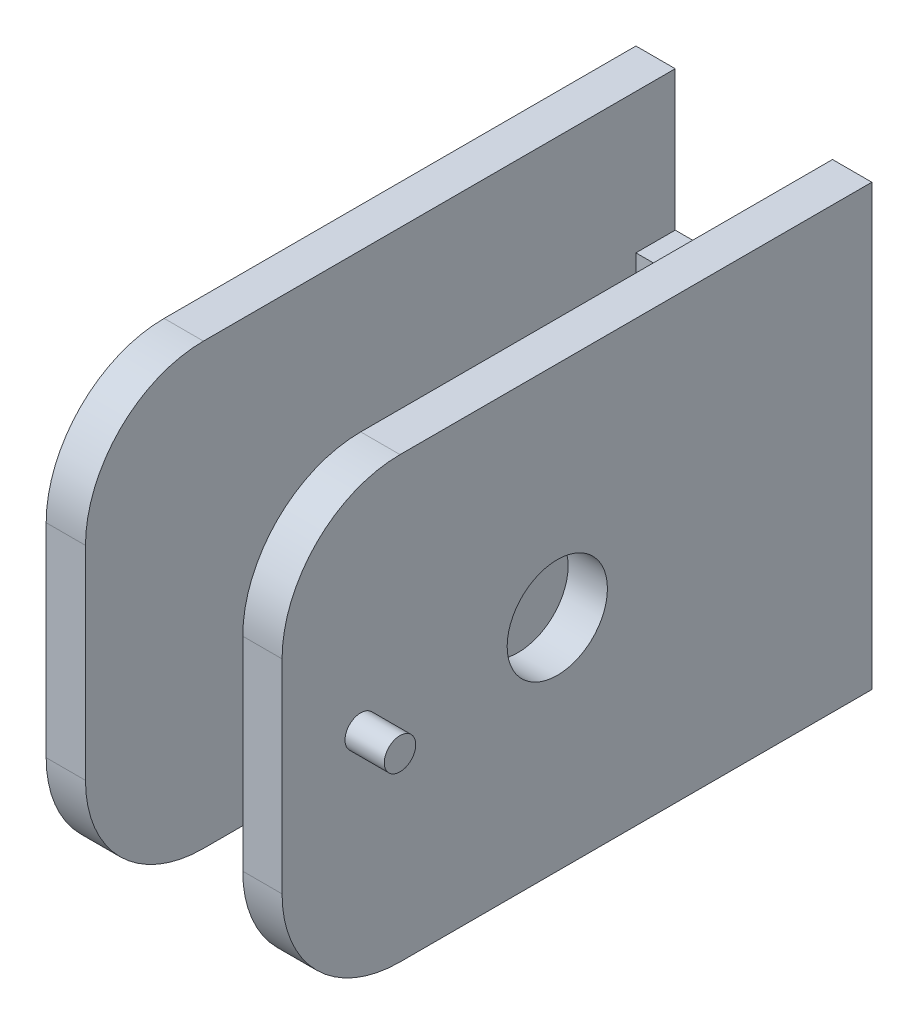
ISO-10303-21;
HEADER;
FILE_DESCRIPTION(('STEP AP214'),'2;1');
FILE_NAME('part.step','',(''),(''),'','','');
FILE_SCHEMA(('AUTOMOTIVE_DESIGN { 1 0 10303 214 1 1 1 1 }'));
ENDSEC;
DATA;
#1=APPLICATION_CONTEXT('core data for automotive mechanical design processes');
#2=APPLICATION_PROTOCOL_DEFINITION('international standard','automotive_design',2000,#1);
#3=PRODUCT_CONTEXT('',#1,'mechanical');
#4=PRODUCT('Part','Part','',(#3));
#5=PRODUCT_RELATED_PRODUCT_CATEGORY('part','',(#4));
#6=PRODUCT_DEFINITION_FORMATION('','',#4);
#7=PRODUCT_DEFINITION_CONTEXT('part definition',#1,'design');
#8=PRODUCT_DEFINITION('design','',#6,#7);
#9=PRODUCT_DEFINITION_SHAPE('','',#8);
#10=(LENGTH_UNIT() NAMED_UNIT(*) SI_UNIT(.MILLI.,.METRE.));
#11=(NAMED_UNIT(*) PLANE_ANGLE_UNIT() SI_UNIT($,.RADIAN.));
#12=(NAMED_UNIT(*) SI_UNIT($,.STERADIAN.) SOLID_ANGLE_UNIT());
#13=UNCERTAINTY_MEASURE_WITH_UNIT(LENGTH_MEASURE(1.E-05),#10,'distance_accuracy_value','');
#14=(GEOMETRIC_REPRESENTATION_CONTEXT(3) GLOBAL_UNCERTAINTY_ASSIGNED_CONTEXT((#13)) GLOBAL_UNIT_ASSIGNED_CONTEXT((#10,
#11,#12)) REPRESENTATION_CONTEXT('',''));
#15=CARTESIAN_POINT('',(0.,0.,0.));
#16=DIRECTION('',(0.,0.,1.));
#17=DIRECTION('',(1.,0.,0.));
#18=AXIS2_PLACEMENT_3D('',#15,#16,#17);
#19=CARTESIAN_POINT('',(-7.5,13.97,-20.));
#20=DIRECTION('',(0.,0.,1.));
#21=DIRECTION('',(1.,0.,0.));
#22=AXIS2_PLACEMENT_3D('',#19,#20,#21);
#23=PLANE('',#22);
#24=DIRECTION('',(0.,1.,0.));
#25=VECTOR('',#24,1.);
#26=CARTESIAN_POINT('',(5.,5.08,-20.));
#27=LINE('',#26,#25);
#28=CARTESIAN_POINT('',(5.,5.08,-20.));
#29=VERTEX_POINT('',#28);
#30=CARTESIAN_POINT('',(5.,13.97,-20.));
#31=VERTEX_POINT('',#30);
#32=EDGE_CURVE('E178',#29,#31,#27,.T.);
#33=ORIENTED_EDGE('',*,*,#32,.T.);
#34=DIRECTION('',(-1.,0.,0.));
#35=VECTOR('',#34,1.);
#36=CARTESIAN_POINT('',(-7.5,13.97,-20.));
#37=LINE('',#36,#35);
#38=CARTESIAN_POINT('',(7.5,13.97,-20.));
#39=VERTEX_POINT('',#38);
#40=EDGE_CURVE('E284',#39,#31,#37,.T.);
#41=ORIENTED_EDGE('',*,*,#40,.F.);
#42=DIRECTION('',(0.,-1.,0.));
#43=VECTOR('',#42,1.);
#44=CARTESIAN_POINT('',(7.5,13.97,-20.));
#45=LINE('',#44,#43);
#46=CARTESIAN_POINT('',(7.5,-13.97,-20.));
#47=VERTEX_POINT('',#46);
#48=EDGE_CURVE('E211',#39,#47,#45,.T.);
#49=ORIENTED_EDGE('',*,*,#48,.T.);
#50=DIRECTION('',(-1.,0.,0.));
#51=VECTOR('',#50,1.);
#52=CARTESIAN_POINT('',(-7.5,-13.97,-20.));
#53=LINE('',#52,#51);
#54=CARTESIAN_POINT('',(5.,-13.97,-20.));
#55=VERTEX_POINT('',#54);
#56=EDGE_CURVE('E302',#47,#55,#53,.T.);
#57=ORIENTED_EDGE('',*,*,#56,.T.);
#58=DIRECTION('',(0.,-1.,0.));
#59=VECTOR('',#58,1.);
#60=CARTESIAN_POINT('',(5.,-5.08,-20.));
#61=LINE('',#60,#59);
#62=CARTESIAN_POINT('',(5.,-5.08,-20.));
#63=VERTEX_POINT('',#62);
#64=EDGE_CURVE('E337',#63,#55,#61,.T.);
#65=ORIENTED_EDGE('',*,*,#64,.F.);
#66=DIRECTION('',(1.,0.,0.));
#67=VECTOR('',#66,1.);
#68=CARTESIAN_POINT('',(-5.,-5.08,-20.));
#69=LINE('',#68,#67);
#70=CARTESIAN_POINT('',(-5.,-5.08,-20.));
#71=VERTEX_POINT('',#70);
#72=EDGE_CURVE('E335',#71,#63,#69,.T.);
#73=ORIENTED_EDGE('',*,*,#72,.F.);
#74=DIRECTION('',(0.,1.,0.));
#75=VECTOR('',#74,1.);
#76=CARTESIAN_POINT('',(-5.,-5.08,-20.));
#77=LINE('',#76,#75);
#78=CARTESIAN_POINT('',(-5.,-13.97,-20.));
#79=VERTEX_POINT('',#78);
#80=EDGE_CURVE('E326',#79,#71,#77,.T.);
#81=ORIENTED_EDGE('',*,*,#80,.F.);
#82=CARTESIAN_POINT('',(-7.5,-13.97,-20.));
#83=VERTEX_POINT('',#82);
#84=EDGE_CURVE('E304',#79,#83,#53,.T.);
#85=ORIENTED_EDGE('',*,*,#84,.T.);
#86=DIRECTION('',(0.,-1.,0.));
#87=VECTOR('',#86,1.);
#88=CARTESIAN_POINT('',(-7.5,13.97,-20.));
#89=LINE('',#88,#87);
#90=CARTESIAN_POINT('',(-7.5,13.97,-20.));
#91=VERTEX_POINT('',#90);
#92=EDGE_CURVE('E207',#91,#83,#89,.T.);
#93=ORIENTED_EDGE('',*,*,#92,.F.);
#94=CARTESIAN_POINT('',(-5.,13.97,-20.));
#95=VERTEX_POINT('',#94);
#96=EDGE_CURVE('E357',#95,#91,#37,.T.);
#97=ORIENTED_EDGE('',*,*,#96,.F.);
#98=DIRECTION('',(0.,-1.,0.));
#99=VECTOR('',#98,1.);
#100=CARTESIAN_POINT('',(-5.,5.08,-20.));
#101=LINE('',#100,#99);
#102=CARTESIAN_POINT('',(-5.,5.08,-20.));
#103=VERTEX_POINT('',#102);
#104=EDGE_CURVE('E181',#95,#103,#101,.T.);
#105=ORIENTED_EDGE('',*,*,#104,.T.);
#106=DIRECTION('',(1.,0.,0.));
#107=VECTOR('',#106,1.);
#108=CARTESIAN_POINT('',(-5.,5.08,-20.));
#109=LINE('',#108,#107);
#110=EDGE_CURVE('E397',#103,#29,#109,.T.);
#111=ORIENTED_EDGE('',*,*,#110,.T.);
#112=EDGE_LOOP('',(#33,#41,#49,#57,#65,#73,#81,#85,#93,#97,#105,#111));
#113=FACE_BOUND('',#112,.T.);
#114=ADVANCED_FACE('F45',(#113),#23,.F.);
#115=CARTESIAN_POINT('',(-5.,13.97,-17.5));
#116=DIRECTION('',(0.,0.,-1.));
#117=DIRECTION('',(-1.,0.,0.));
#118=AXIS2_PLACEMENT_3D('',#115,#116,#117);
#119=PLANE('',#118);
#120=DIRECTION('',(-1.,0.,0.));
#121=VECTOR('',#120,1.);
#122=CARTESIAN_POINT('',(-5.,5.08,-17.5));
#123=LINE('',#122,#121);
#124=CARTESIAN_POINT('',(5.,5.08,-17.5));
#125=VERTEX_POINT('',#124);
#126=CARTESIAN_POINT('',(-5.,5.08,-17.5));
#127=VERTEX_POINT('',#126);
#128=EDGE_CURVE('E160',#125,#127,#123,.T.);
#129=ORIENTED_EDGE('',*,*,#128,.T.);
#130=DIRECTION('',(0.,-1.,0.));
#131=VECTOR('',#130,1.);
#132=CARTESIAN_POINT('',(-5.,13.97,-17.5));
#133=LINE('',#132,#131);
#134=CARTESIAN_POINT('',(-5.,-5.08,-17.5));
#135=VERTEX_POINT('',#134);
#136=EDGE_CURVE('E188',#127,#135,#133,.T.);
#137=ORIENTED_EDGE('',*,*,#136,.T.);
#138=DIRECTION('',(-1.,0.,0.));
#139=VECTOR('',#138,1.);
#140=CARTESIAN_POINT('',(-5.,-5.08,-17.5));
#141=LINE('',#140,#139);
#142=CARTESIAN_POINT('',(5.,-5.08,-17.5));
#143=VERTEX_POINT('',#142);
#144=EDGE_CURVE('E186',#143,#135,#141,.T.);
#145=ORIENTED_EDGE('',*,*,#144,.F.);
#146=DIRECTION('',(0.,-1.,0.));
#147=VECTOR('',#146,1.);
#148=CARTESIAN_POINT('',(5.,13.97,-17.5));
#149=LINE('',#148,#147);
#150=EDGE_CURVE('E175',#125,#143,#149,.T.);
#151=ORIENTED_EDGE('',*,*,#150,.F.);
#152=EDGE_LOOP('',(#129,#137,#145,#151));
#153=FACE_BOUND('',#152,.T.);
#154=ADVANCED_FACE('F184',(#153),#119,.F.);
#155=CARTESIAN_POINT('',(0.,13.97,0.));
#156=DIRECTION('',(0.,-1.,0.));
#157=DIRECTION('',(0.,0.,-1.));
#158=AXIS2_PLACEMENT_3D('',#155,#156,#157);
#159=PLANE('',#158);
#160=ORIENTED_EDGE('',*,*,#40,.T.);
#161=DIRECTION('',(0.,0.,1.));
#162=VECTOR('',#161,1.);
#163=CARTESIAN_POINT('',(5.,13.97,17.5));
#164=LINE('',#163,#162);
#165=CARTESIAN_POINT('',(5.,13.97,10.));
#166=VERTEX_POINT('',#165);
#167=EDGE_CURVE('E275',#31,#166,#164,.T.);
#168=ORIENTED_EDGE('',*,*,#167,.T.);
#169=DIRECTION('',(1.,0.,0.));
#170=VECTOR('',#169,1.);
#171=CARTESIAN_POINT('',(0.,13.97,10.));
#172=LINE('',#171,#170);
#173=CARTESIAN_POINT('',(7.5,13.97,10.));
#174=VERTEX_POINT('',#173);
#175=EDGE_CURVE('E249',#166,#174,#172,.T.);
#176=ORIENTED_EDGE('',*,*,#175,.T.);
#177=DIRECTION('',(0.,0.,-1.));
#178=VECTOR('',#177,1.);
#179=CARTESIAN_POINT('',(7.5,13.97,17.5));
#180=LINE('',#179,#178);
#181=EDGE_CURVE('E286',#174,#39,#180,.T.);
#182=ORIENTED_EDGE('',*,*,#181,.T.);
#183=EDGE_LOOP('',(#160,#168,#176,#182));
#184=FACE_BOUND('',#183,.T.);
#185=ADVANCED_FACE('F281',(#184),#159,.F.);
#186=DIRECTION('',(0.,0.,-1.));
#187=VECTOR('',#186,1.);
#188=CARTESIAN_POINT('',(-5.,13.97,17.5));
#189=LINE('',#188,#187);
#190=CARTESIAN_POINT('',(-5.,13.97,10.));
#191=VERTEX_POINT('',#190);
#192=EDGE_CURVE('E62',#191,#95,#189,.T.);
#193=ORIENTED_EDGE('',*,*,#192,.T.);
#194=ORIENTED_EDGE('',*,*,#96,.T.);
#195=DIRECTION('',(0.,0.,1.));
#196=VECTOR('',#195,1.);
#197=CARTESIAN_POINT('',(-7.5,13.97,17.5));
#198=LINE('',#197,#196);
#199=CARTESIAN_POINT('',(-7.5,13.97,10.));
#200=VERTEX_POINT('',#199);
#201=EDGE_CURVE('E194',#91,#200,#198,.T.);
#202=ORIENTED_EDGE('',*,*,#201,.T.);
#203=DIRECTION('',(1.,0.,0.));
#204=VECTOR('',#203,1.);
#205=CARTESIAN_POINT('',(0.,13.97,10.));
#206=LINE('',#205,#204);
#207=EDGE_CURVE('E253',#200,#191,#206,.T.);
#208=ORIENTED_EDGE('',*,*,#207,.T.);
#209=EDGE_LOOP('',(#193,#194,#202,#208));
#210=FACE_BOUND('',#209,.T.);
#211=ADVANCED_FACE('F355',(#210),#159,.F.);
#212=CARTESIAN_POINT('',(0.,-13.97,0.));
#213=DIRECTION('',(0.,-1.,0.));
#214=DIRECTION('',(0.,0.,-1.));
#215=AXIS2_PLACEMENT_3D('',#212,#213,#214);
#216=PLANE('',#215);
#217=DIRECTION('',(0.,0.,-1.));
#218=VECTOR('',#217,1.);
#219=CARTESIAN_POINT('',(7.5,-13.97,17.5));
#220=LINE('',#219,#218);
#221=CARTESIAN_POINT('',(7.5,-13.97,10.));
#222=VERTEX_POINT('',#221);
#223=EDGE_CURVE('E298',#222,#47,#220,.T.);
#224=ORIENTED_EDGE('',*,*,#223,.F.);
#225=DIRECTION('',(1.,0.,0.));
#226=VECTOR('',#225,1.);
#227=CARTESIAN_POINT('',(5.,-13.97,10.));
#228=LINE('',#227,#226);
#229=CARTESIAN_POINT('',(5.,-13.97,10.));
#230=VERTEX_POINT('',#229);
#231=EDGE_CURVE('E70',#222,#230,#228,.F.);
#232=ORIENTED_EDGE('',*,*,#231,.T.);
#233=DIRECTION('',(0.,0.,1.));
#234=VECTOR('',#233,1.);
#235=CARTESIAN_POINT('',(5.,-13.97,17.5));
#236=LINE('',#235,#234);
#237=EDGE_CURVE('E305',#55,#230,#236,.T.);
#238=ORIENTED_EDGE('',*,*,#237,.F.);
#239=ORIENTED_EDGE('',*,*,#56,.F.);
#240=EDGE_LOOP('',(#224,#232,#238,#239));
#241=FACE_BOUND('',#240,.T.);
#242=ADVANCED_FACE('F300',(#241),#216,.T.);
#243=CARTESIAN_POINT('',(5.,13.97,17.5));
#244=DIRECTION('',(1.,0.,0.));
#245=DIRECTION('',(0.,0.,-1.));
#246=AXIS2_PLACEMENT_3D('',#243,#244,#245);
#247=PLANE('',#246);
#248=CARTESIAN_POINT('',(5.,0.,0.));
#249=DIRECTION('',(1.,0.,0.));
#250=DIRECTION('',(0.,0.,-1.));
#251=AXIS2_PLACEMENT_3D('',#248,#249,#250);
#252=CIRCLE('',#251,3.1877);
#253=CARTESIAN_POINT('',(5.,0.,-3.1877));
#254=VERTEX_POINT('',#253);
#255=EDGE_CURVE('E381',#254,#254,#252,.F.);
#256=ORIENTED_EDGE('',*,*,#255,.F.);
#257=EDGE_LOOP('',(#256));
#258=FACE_BOUND('',#257,.T.);
#259=ORIENTED_EDGE('',*,*,#237,.T.);
#260=CARTESIAN_POINT('',(5.,-6.47,10.));
#261=DIRECTION('',(1.,0.,0.));
#262=DIRECTION('',(0.,0.,-1.));
#263=AXIS2_PLACEMENT_3D('',#260,#261,#262);
#264=CIRCLE('',#263,7.5);
#265=CARTESIAN_POINT('',(5.,-6.47,17.5));
#266=VERTEX_POINT('',#265);
#267=EDGE_CURVE('E11',#230,#266,#264,.F.);
#268=ORIENTED_EDGE('',*,*,#267,.T.);
#269=DIRECTION('',(0.,-1.,0.));
#270=VECTOR('',#269,1.);
#271=CARTESIAN_POINT('',(5.,13.97,17.5));
#272=LINE('',#271,#270);
#273=CARTESIAN_POINT('',(5.,6.47,17.5));
#274=VERTEX_POINT('',#273);
#275=EDGE_CURVE('E219',#274,#266,#272,.T.);
#276=ORIENTED_EDGE('',*,*,#275,.F.);
#277=CARTESIAN_POINT('',(5.,6.47,10.));
#278=DIRECTION('',(1.,0.,0.));
#279=DIRECTION('',(0.,0.,-1.));
#280=AXIS2_PLACEMENT_3D('',#277,#278,#279);
#281=CIRCLE('',#280,7.5);
#282=EDGE_CURVE('E55',#274,#166,#281,.F.);
#283=ORIENTED_EDGE('',*,*,#282,.T.);
#284=ORIENTED_EDGE('',*,*,#167,.F.);
#285=ORIENTED_EDGE('',*,*,#32,.F.);
#286=DIRECTION('',(0.,0.,-1.));
#287=VECTOR('',#286,1.);
#288=CARTESIAN_POINT('',(5.,5.08,17.501));
#289=LINE('',#288,#287);
#290=EDGE_CURVE('E164',#125,#29,#289,.T.);
#291=ORIENTED_EDGE('',*,*,#290,.F.);
#292=ORIENTED_EDGE('',*,*,#150,.T.);
#293=DIRECTION('',(0.,0.,-1.));
#294=VECTOR('',#293,1.);
#295=CARTESIAN_POINT('',(5.,-5.08,17.501));
#296=LINE('',#295,#294);
#297=EDGE_CURVE('E368',#143,#63,#296,.T.);
#298=ORIENTED_EDGE('',*,*,#297,.T.);
#299=ORIENTED_EDGE('',*,*,#64,.T.);
#300=EDGE_LOOP('',(#259,#268,#276,#283,#284,#285,#291,#292,#298,#299));
#301=FACE_BOUND('',#300,.T.);
#302=ADVANCED_FACE('F174',(#258,#301),#247,.F.);
#303=CARTESIAN_POINT('',(5.,13.97,17.5));
#304=DIRECTION('',(0.,0.,-1.));
#305=DIRECTION('',(-1.,0.,0.));
#306=AXIS2_PLACEMENT_3D('',#303,#304,#305);
#307=PLANE('',#306);
#308=ORIENTED_EDGE('',*,*,#275,.T.);
#309=DIRECTION('',(1.,0.,0.));
#310=VECTOR('',#309,1.);
#311=CARTESIAN_POINT('',(7.5,-6.47,17.5));
#312=LINE('',#311,#310);
#313=CARTESIAN_POINT('',(7.5,-6.47,17.5));
#314=VERTEX_POINT('',#313);
#315=EDGE_CURVE('E259',#266,#314,#312,.T.);
#316=ORIENTED_EDGE('',*,*,#315,.T.);
#317=DIRECTION('',(0.,-1.,0.));
#318=VECTOR('',#317,1.);
#319=CARTESIAN_POINT('',(7.5,13.97,17.5));
#320=LINE('',#319,#318);
#321=CARTESIAN_POINT('',(7.5,6.47,17.5));
#322=VERTEX_POINT('',#321);
#323=EDGE_CURVE('E215',#322,#314,#320,.T.);
#324=ORIENTED_EDGE('',*,*,#323,.F.);
#325=DIRECTION('',(1.,0.,0.));
#326=VECTOR('',#325,1.);
#327=CARTESIAN_POINT('',(5.,6.47,17.5));
#328=LINE('',#327,#326);
#329=EDGE_CURVE('E256',#322,#274,#328,.F.);
#330=ORIENTED_EDGE('',*,*,#329,.T.);
#331=EDGE_LOOP('',(#308,#316,#324,#330));
#332=FACE_BOUND('',#331,.T.);
#333=ADVANCED_FACE('F293',(#332),#307,.F.);
#334=CARTESIAN_POINT('',(7.5,13.97,17.5));
#335=DIRECTION('',(-1.,0.,0.));
#336=DIRECTION('',(0.,0.,1.));
#337=AXIS2_PLACEMENT_3D('',#334,#335,#336);
#338=PLANE('',#337);
#339=CARTESIAN_POINT('',(7.5,0.,0.));
#340=DIRECTION('',(-1.,0.,0.));
#341=DIRECTION('',(0.,0.,1.));
#342=AXIS2_PLACEMENT_3D('',#339,#340,#341);
#343=CIRCLE('',#342,3.1877);
#344=CARTESIAN_POINT('',(7.5,0.,3.1877));
#345=VERTEX_POINT('',#344);
#346=EDGE_CURVE('E385',#345,#345,#343,.F.);
#347=ORIENTED_EDGE('',*,*,#346,.F.);
#348=EDGE_LOOP('',(#347));
#349=FACE_BOUND('',#348,.T.);
#350=CARTESIAN_POINT('',(7.5,0.,12.5));
#351=DIRECTION('',(-1.,0.,0.));
#352=DIRECTION('',(0.,0.,1.));
#353=AXIS2_PLACEMENT_3D('',#350,#351,#352);
#354=CIRCLE('',#353,1.);
#355=CARTESIAN_POINT('',(7.5,0.,13.5));
#356=VERTEX_POINT('',#355);
#357=EDGE_CURVE('E223',#356,#356,#354,.F.);
#358=ORIENTED_EDGE('',*,*,#357,.F.);
#359=EDGE_LOOP('',(#358));
#360=FACE_BOUND('',#359,.T.);
#361=ORIENTED_EDGE('',*,*,#323,.T.);
#362=CARTESIAN_POINT('',(7.5,-6.47,10.));
#363=DIRECTION('',(-1.,0.,0.));
#364=DIRECTION('',(0.,0.,1.));
#365=AXIS2_PLACEMENT_3D('',#362,#363,#364);
#366=CIRCLE('',#365,7.5);
#367=EDGE_CURVE('E266',#314,#222,#366,.F.);
#368=ORIENTED_EDGE('',*,*,#367,.T.);
#369=ORIENTED_EDGE('',*,*,#223,.T.);
#370=ORIENTED_EDGE('',*,*,#48,.F.);
#371=ORIENTED_EDGE('',*,*,#181,.F.);
#372=CARTESIAN_POINT('',(7.5,6.47,10.));
#373=DIRECTION('',(-1.,0.,0.));
#374=DIRECTION('',(0.,0.,1.));
#375=AXIS2_PLACEMENT_3D('',#372,#373,#374);
#376=CIRCLE('',#375,7.5);
#377=EDGE_CURVE('E263',#174,#322,#376,.F.);
#378=ORIENTED_EDGE('',*,*,#377,.T.);
#379=EDGE_LOOP('',(#361,#368,#369,#370,#371,#378));
#380=FACE_BOUND('',#379,.T.);
#381=ADVANCED_FACE('F290',(#349,#360,#380),#338,.F.);
#382=CARTESIAN_POINT('',(-7.5,13.97,17.5));
#383=DIRECTION('',(1.,0.,0.));
#384=DIRECTION('',(0.,0.,-1.));
#385=AXIS2_PLACEMENT_3D('',#382,#383,#384);
#386=PLANE('',#385);
#387=CARTESIAN_POINT('',(-7.5,0.,0.));
#388=DIRECTION('',(-1.,0.,0.));
#389=DIRECTION('',(0.,0.,1.));
#390=AXIS2_PLACEMENT_3D('',#387,#388,#389);
#391=CIRCLE('',#390,3.1877);
#392=CARTESIAN_POINT('',(-7.5,0.,3.1877));
#393=VERTEX_POINT('',#392);
#394=EDGE_CURVE('E171',#393,#393,#391,.T.);
#395=ORIENTED_EDGE('',*,*,#394,.F.);
#396=EDGE_LOOP('',(#395));
#397=FACE_BOUND('',#396,.T.);
#398=DIRECTION('',(0.,0.,1.));
#399=VECTOR('',#398,1.);
#400=CARTESIAN_POINT('',(-7.5,-13.97,17.5));
#401=LINE('',#400,#399);
#402=CARTESIAN_POINT('',(-7.5,-13.97,10.));
#403=VERTEX_POINT('',#402);
#404=EDGE_CURVE('E313',#83,#403,#401,.T.);
#405=ORIENTED_EDGE('',*,*,#404,.T.);
#406=CARTESIAN_POINT('',(-7.5,-6.47,10.));
#407=DIRECTION('',(1.,0.,0.));
#408=DIRECTION('',(0.,0.,-1.));
#409=AXIS2_PLACEMENT_3D('',#406,#407,#408);
#410=CIRCLE('',#409,7.5);
#411=CARTESIAN_POINT('',(-7.5,-6.47,17.5));
#412=VERTEX_POINT('',#411);
#413=EDGE_CURVE('E246',#403,#412,#410,.F.);
#414=ORIENTED_EDGE('',*,*,#413,.T.);
#415=DIRECTION('',(0.,-1.,0.));
#416=VECTOR('',#415,1.);
#417=CARTESIAN_POINT('',(-7.5,13.97,17.5));
#418=LINE('',#417,#416);
#419=CARTESIAN_POINT('',(-7.5,6.47,17.5));
#420=VERTEX_POINT('',#419);
#421=EDGE_CURVE('E203',#420,#412,#418,.T.);
#422=ORIENTED_EDGE('',*,*,#421,.F.);
#423=CARTESIAN_POINT('',(-7.5,6.47,10.));
#424=DIRECTION('',(1.,0.,0.));
#425=DIRECTION('',(0.,0.,-1.));
#426=AXIS2_PLACEMENT_3D('',#423,#424,#425);
#427=CIRCLE('',#426,7.5);
#428=EDGE_CURVE('E243',#420,#200,#427,.F.);
#429=ORIENTED_EDGE('',*,*,#428,.T.);
#430=ORIENTED_EDGE('',*,*,#201,.F.);
#431=ORIENTED_EDGE('',*,*,#92,.T.);
#432=EDGE_LOOP('',(#405,#414,#422,#429,#430,#431));
#433=FACE_BOUND('',#432,.T.);
#434=ADVANCED_FACE('F344',(#397,#433),#386,.F.);
#435=CARTESIAN_POINT('',(-5.,13.97,17.5));
#436=DIRECTION('',(0.,0.,-1.));
#437=DIRECTION('',(-1.,0.,0.));
#438=AXIS2_PLACEMENT_3D('',#435,#436,#437);
#439=PLANE('',#438);
#440=ORIENTED_EDGE('',*,*,#421,.T.);
#441=DIRECTION('',(1.,0.,0.));
#442=VECTOR('',#441,1.);
#443=CARTESIAN_POINT('',(-5.,-6.47,17.5));
#444=LINE('',#443,#442);
#445=CARTESIAN_POINT('',(-5.,-6.47,17.5));
#446=VERTEX_POINT('',#445);
#447=EDGE_CURVE('E230',#412,#446,#444,.T.);
#448=ORIENTED_EDGE('',*,*,#447,.T.);
#449=DIRECTION('',(0.,-1.,0.));
#450=VECTOR('',#449,1.);
#451=CARTESIAN_POINT('',(-5.,13.97,17.5));
#452=LINE('',#451,#450);
#453=CARTESIAN_POINT('',(-5.,6.47,17.5));
#454=VERTEX_POINT('',#453);
#455=EDGE_CURVE('E192',#454,#446,#452,.T.);
#456=ORIENTED_EDGE('',*,*,#455,.F.);
#457=DIRECTION('',(1.,0.,0.));
#458=VECTOR('',#457,1.);
#459=CARTESIAN_POINT('',(-5.,6.47,17.5));
#460=LINE('',#459,#458);
#461=EDGE_CURVE('E227',#454,#420,#460,.F.);
#462=ORIENTED_EDGE('',*,*,#461,.T.);
#463=EDGE_LOOP('',(#440,#448,#456,#462));
#464=FACE_BOUND('',#463,.T.);
#465=ADVANCED_FACE('F347',(#464),#439,.F.);
#466=CARTESIAN_POINT('',(-5.,13.97,17.5));
#467=DIRECTION('',(-1.,0.,0.));
#468=DIRECTION('',(0.,0.,1.));
#469=AXIS2_PLACEMENT_3D('',#466,#467,#468);
#470=PLANE('',#469);
#471=CARTESIAN_POINT('',(-5.,0.,0.));
#472=DIRECTION('',(-1.,0.,0.));
#473=DIRECTION('',(0.,0.,1.));
#474=AXIS2_PLACEMENT_3D('',#471,#472,#473);
#475=CIRCLE('',#474,3.1877);
#476=CARTESIAN_POINT('',(-5.,0.,3.1877));
#477=VERTEX_POINT('',#476);
#478=EDGE_CURVE('E49',#477,#477,#475,.F.);
#479=ORIENTED_EDGE('',*,*,#478,.F.);
#480=EDGE_LOOP('',(#479));
#481=FACE_BOUND('',#480,.T.);
#482=ORIENTED_EDGE('',*,*,#455,.T.);
#483=CARTESIAN_POINT('',(-5.,-6.47,10.));
#484=DIRECTION('',(-1.,0.,0.));
#485=DIRECTION('',(0.,0.,1.));
#486=AXIS2_PLACEMENT_3D('',#483,#484,#485);
#487=CIRCLE('',#486,7.5);
#488=CARTESIAN_POINT('',(-5.,-13.97,10.));
#489=VERTEX_POINT('',#488);
#490=EDGE_CURVE('E237',#446,#489,#487,.F.);
#491=ORIENTED_EDGE('',*,*,#490,.T.);
#492=DIRECTION('',(0.,0.,-1.));
#493=VECTOR('',#492,1.);
#494=CARTESIAN_POINT('',(-5.,-13.97,17.5));
#495=LINE('',#494,#493);
#496=EDGE_CURVE('E197',#489,#79,#495,.T.);
#497=ORIENTED_EDGE('',*,*,#496,.T.);
#498=ORIENTED_EDGE('',*,*,#80,.T.);
#499=DIRECTION('',(0.,0.,-1.));
#500=VECTOR('',#499,1.);
#501=CARTESIAN_POINT('',(-5.,-5.08,17.501));
#502=LINE('',#501,#500);
#503=EDGE_CURVE('E369',#135,#71,#502,.T.);
#504=ORIENTED_EDGE('',*,*,#503,.F.);
#505=ORIENTED_EDGE('',*,*,#136,.F.);
#506=DIRECTION('',(0.,0.,-1.));
#507=VECTOR('',#506,1.);
#508=CARTESIAN_POINT('',(-5.,5.08,17.501));
#509=LINE('',#508,#507);
#510=EDGE_CURVE('E166',#127,#103,#509,.T.);
#511=ORIENTED_EDGE('',*,*,#510,.T.);
#512=ORIENTED_EDGE('',*,*,#104,.F.);
#513=ORIENTED_EDGE('',*,*,#192,.F.);
#514=CARTESIAN_POINT('',(-5.,6.47,10.));
#515=DIRECTION('',(-1.,0.,0.));
#516=DIRECTION('',(0.,0.,1.));
#517=AXIS2_PLACEMENT_3D('',#514,#515,#516);
#518=CIRCLE('',#517,7.5);
#519=EDGE_CURVE('E234',#191,#454,#518,.F.);
#520=ORIENTED_EDGE('',*,*,#519,.T.);
#521=EDGE_LOOP('',(#482,#491,#497,#498,#504,#505,#511,#512,#513,#520));
#522=FACE_BOUND('',#521,.T.);
#523=ADVANCED_FACE('F324',(#481,#522),#470,.F.);
#524=ORIENTED_EDGE('',*,*,#496,.F.);
#525=DIRECTION('',(1.,0.,0.));
#526=VECTOR('',#525,1.);
#527=CARTESIAN_POINT('',(-7.5,-13.97,10.));
#528=LINE('',#527,#526);
#529=EDGE_CURVE('E240',#489,#403,#528,.F.);
#530=ORIENTED_EDGE('',*,*,#529,.T.);
#531=ORIENTED_EDGE('',*,*,#404,.F.);
#532=ORIENTED_EDGE('',*,*,#84,.F.);
#533=EDGE_LOOP('',(#524,#530,#531,#532));
#534=FACE_BOUND('',#533,.T.);
#535=ADVANCED_FACE('F339',(#534),#216,.T.);
#536=CARTESIAN_POINT('',(10.,0.,12.5));
#537=DIRECTION('',(-1.,0.,0.));
#538=DIRECTION('',(0.,0.,1.));
#539=AXIS2_PLACEMENT_3D('',#536,#537,#538);
#540=CYLINDRICAL_SURFACE('',#539,1.);
#541=CARTESIAN_POINT('',(10.,0.,12.5));
#542=DIRECTION('',(1.,0.,0.));
#543=DIRECTION('',(0.,0.,-1.));
#544=AXIS2_PLACEMENT_3D('',#541,#542,#543);
#545=CIRCLE('',#544,1.);
#546=CARTESIAN_POINT('',(10.,0.,11.5));
#547=VERTEX_POINT('',#546);
#548=EDGE_CURVE('E310',#547,#547,#545,.T.);
#549=ORIENTED_EDGE('',*,*,#548,.F.);
#550=EDGE_LOOP('',(#549));
#551=FACE_BOUND('',#550,.T.);
#552=ORIENTED_EDGE('',*,*,#357,.T.);
#553=EDGE_LOOP('',(#552));
#554=FACE_BOUND('',#553,.T.);
#555=ADVANCED_FACE('F412',(#551,#554),#540,.T.);
#556=CARTESIAN_POINT('',(10.,0.,12.5));
#557=DIRECTION('',(1.,0.,0.));
#558=DIRECTION('',(0.,0.,-1.));
#559=AXIS2_PLACEMENT_3D('',#556,#557,#558);
#560=PLANE('',#559);
#561=ORIENTED_EDGE('',*,*,#548,.T.);
#562=EDGE_LOOP('',(#561));
#563=FACE_BOUND('',#562,.T.);
#564=ADVANCED_FACE('F404',(#563),#560,.T.);
#565=CARTESIAN_POINT('',(-5.,-5.08,17.501));
#566=DIRECTION('',(0.,1.,0.));
#567=DIRECTION('',(0.,0.,1.));
#568=AXIS2_PLACEMENT_3D('',#565,#566,#567);
#569=PLANE('',#568);
#570=ORIENTED_EDGE('',*,*,#144,.T.);
#571=ORIENTED_EDGE('',*,*,#503,.T.);
#572=ORIENTED_EDGE('',*,*,#72,.T.);
#573=ORIENTED_EDGE('',*,*,#297,.F.);
#574=EDGE_LOOP('',(#570,#571,#572,#573));
#575=FACE_BOUND('',#574,.T.);
#576=ADVANCED_FACE('F402',(#575),#569,.F.);
#577=CARTESIAN_POINT('',(-5.,-6.47,10.));
#578=DIRECTION('',(-1.,0.,0.));
#579=DIRECTION('',(0.,0.,1.));
#580=AXIS2_PLACEMENT_3D('',#577,#578,#579);
#581=CYLINDRICAL_SURFACE('',#580,7.5);
#582=ORIENTED_EDGE('',*,*,#413,.F.);
#583=ORIENTED_EDGE('',*,*,#529,.F.);
#584=ORIENTED_EDGE('',*,*,#490,.F.);
#585=ORIENTED_EDGE('',*,*,#447,.F.);
#586=EDGE_LOOP('',(#582,#583,#584,#585));
#587=FACE_BOUND('',#586,.T.);
#588=ADVANCED_FACE('F341',(#587),#581,.T.);
#589=CARTESIAN_POINT('',(0.,6.47,10.));
#590=DIRECTION('',(1.,0.,0.));
#591=DIRECTION('',(0.,0.,-1.));
#592=AXIS2_PLACEMENT_3D('',#589,#590,#591);
#593=CYLINDRICAL_SURFACE('',#592,7.5);
#594=ORIENTED_EDGE('',*,*,#428,.F.);
#595=ORIENTED_EDGE('',*,*,#461,.F.);
#596=ORIENTED_EDGE('',*,*,#519,.F.);
#597=ORIENTED_EDGE('',*,*,#207,.F.);
#598=EDGE_LOOP('',(#594,#595,#596,#597));
#599=FACE_BOUND('',#598,.T.);
#600=ADVANCED_FACE('F351',(#599),#593,.T.);
#601=CARTESIAN_POINT('',(5.,-6.47,10.));
#602=DIRECTION('',(-1.,0.,0.));
#603=DIRECTION('',(0.,0.,1.));
#604=AXIS2_PLACEMENT_3D('',#601,#602,#603);
#605=CYLINDRICAL_SURFACE('',#604,7.5);
#606=ORIENTED_EDGE('',*,*,#267,.F.);
#607=ORIENTED_EDGE('',*,*,#231,.F.);
#608=ORIENTED_EDGE('',*,*,#367,.F.);
#609=ORIENTED_EDGE('',*,*,#315,.F.);
#610=EDGE_LOOP('',(#606,#607,#608,#609));
#611=FACE_BOUND('',#610,.T.);
#612=ADVANCED_FACE('F297',(#611),#605,.T.);
#613=CARTESIAN_POINT('',(0.,6.47,10.));
#614=DIRECTION('',(1.,0.,0.));
#615=DIRECTION('',(0.,0.,-1.));
#616=AXIS2_PLACEMENT_3D('',#613,#614,#615);
#617=CYLINDRICAL_SURFACE('',#616,7.5);
#618=ORIENTED_EDGE('',*,*,#282,.F.);
#619=ORIENTED_EDGE('',*,*,#329,.F.);
#620=ORIENTED_EDGE('',*,*,#377,.F.);
#621=ORIENTED_EDGE('',*,*,#175,.F.);
#622=EDGE_LOOP('',(#618,#619,#620,#621));
#623=FACE_BOUND('',#622,.T.);
#624=ADVANCED_FACE('F47',(#623),#617,.T.);
#625=CARTESIAN_POINT('',(-7.5,0.,0.));
#626=DIRECTION('',(1.,0.,0.));
#627=DIRECTION('',(0.,0.,-1.));
#628=AXIS2_PLACEMENT_3D('',#625,#626,#627);
#629=CYLINDRICAL_SURFACE('',#628,3.1877);
#630=ORIENTED_EDGE('',*,*,#394,.T.);
#631=EDGE_LOOP('',(#630));
#632=FACE_BOUND('',#631,.T.);
#633=ORIENTED_EDGE('',*,*,#478,.T.);
#634=EDGE_LOOP('',(#633));
#635=FACE_BOUND('',#634,.T.);
#636=ADVANCED_FACE('F439',(#632,#635),#629,.F.);
#637=ORIENTED_EDGE('',*,*,#346,.T.);
#638=EDGE_LOOP('',(#637));
#639=FACE_BOUND('',#638,.T.);
#640=ORIENTED_EDGE('',*,*,#255,.T.);
#641=EDGE_LOOP('',(#640));
#642=FACE_BOUND('',#641,.T.);
#643=ADVANCED_FACE('F443',(#639,#642),#629,.F.);
#644=CARTESIAN_POINT('',(-5.,5.08,17.501));
#645=DIRECTION('',(0.,1.,0.));
#646=DIRECTION('',(0.,0.,1.));
#647=AXIS2_PLACEMENT_3D('',#644,#645,#646);
#648=PLANE('',#647);
#649=ORIENTED_EDGE('',*,*,#290,.T.);
#650=ORIENTED_EDGE('',*,*,#110,.F.);
#651=ORIENTED_EDGE('',*,*,#510,.F.);
#652=ORIENTED_EDGE('',*,*,#128,.F.);
#653=EDGE_LOOP('',(#649,#650,#651,#652));
#654=FACE_BOUND('',#653,.T.);
#655=ADVANCED_FACE('F162',(#654),#648,.T.);
#656=CLOSED_SHELL('',(#114,#154,#185,#211,#242,#302,#333,#381,#434,#465,#523,#535,#555,#564,
#576,#588,#600,#612,#624,#636,#643,#655));
#657=MANIFOLD_SOLID_BREP('B2',#656);
#658=ADVANCED_BREP_SHAPE_REPRESENTATION('',(#18,#657),#14);
#659=SHAPE_DEFINITION_REPRESENTATION(#9,#658);
ENDSEC;
END-ISO-10303-21;
